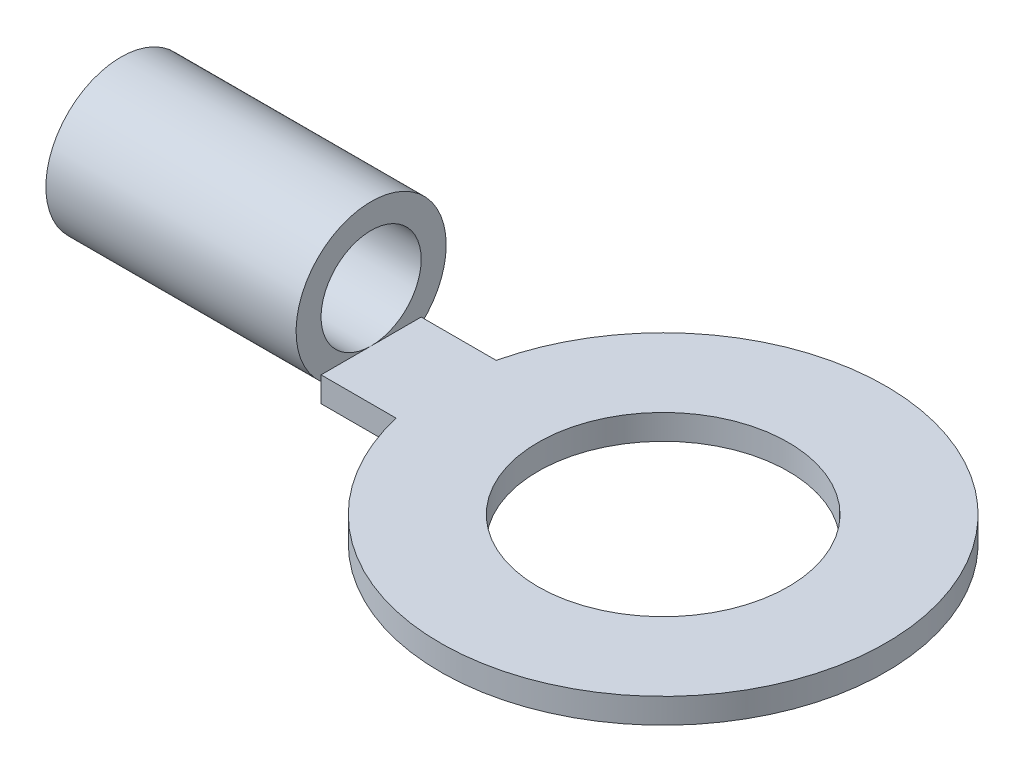
ISO-10303-21;
HEADER;
FILE_DESCRIPTION(('STEP AP214'),'2;1');
FILE_NAME('part.step','',(''),(''),'','','');
FILE_SCHEMA(('AUTOMOTIVE_DESIGN { 1 0 10303 214 1 1 1 1 }'));
ENDSEC;
DATA;
#1=APPLICATION_CONTEXT('core data for automotive mechanical design processes');
#2=APPLICATION_PROTOCOL_DEFINITION('international standard','automotive_design',2000,#1);
#3=PRODUCT_CONTEXT('',#1,'mechanical');
#4=PRODUCT('Part','Part','',(#3));
#5=PRODUCT_RELATED_PRODUCT_CATEGORY('part','',(#4));
#6=PRODUCT_DEFINITION_FORMATION('','',#4);
#7=PRODUCT_DEFINITION_CONTEXT('part definition',#1,'design');
#8=PRODUCT_DEFINITION('design','',#6,#7);
#9=PRODUCT_DEFINITION_SHAPE('','',#8);
#10=(LENGTH_UNIT() NAMED_UNIT(*) SI_UNIT(.MILLI.,.METRE.));
#11=(NAMED_UNIT(*) PLANE_ANGLE_UNIT() SI_UNIT($,.RADIAN.));
#12=(NAMED_UNIT(*) SI_UNIT($,.STERADIAN.) SOLID_ANGLE_UNIT());
#13=UNCERTAINTY_MEASURE_WITH_UNIT(LENGTH_MEASURE(1.E-05),#10,'distance_accuracy_value','');
#14=(GEOMETRIC_REPRESENTATION_CONTEXT(3) GLOBAL_UNCERTAINTY_ASSIGNED_CONTEXT((#13)) GLOBAL_UNIT_ASSIGNED_CONTEXT((#10,
#11,#12)) REPRESENTATION_CONTEXT('',''));
#15=CARTESIAN_POINT('',(0.,0.,0.));
#16=DIRECTION('',(0.,0.,1.));
#17=DIRECTION('',(1.,0.,0.));
#18=AXIS2_PLACEMENT_3D('',#15,#16,#17);
#19=CARTESIAN_POINT('',(0.,0.5,1.));
#20=DIRECTION('',(1.,0.,0.));
#21=DIRECTION('',(0.,0.,-1.));
#22=AXIS2_PLACEMENT_3D('',#19,#20,#21);
#23=PLANE('',#22);
#24=DIRECTION('',(0.,-1.,0.));
#25=VECTOR('',#24,1.);
#26=CARTESIAN_POINT('',(0.,0.5,1.));
#27=LINE('',#26,#25);
#28=CARTESIAN_POINT('',(0.,0.381966011250105,1.));
#29=VERTEX_POINT('',#28);
#30=CARTESIAN_POINT('',(0.,0.,1.));
#31=VERTEX_POINT('',#30);
#32=EDGE_CURVE('E79',#29,#31,#27,.T.);
#33=ORIENTED_EDGE('',*,*,#32,.F.);
#34=CARTESIAN_POINT('',(0.,1.5,0.));
#35=DIRECTION('',(1.,0.,0.));
#36=DIRECTION('',(0.,0.,-1.));
#37=AXIS2_PLACEMENT_3D('',#34,#35,#36);
#38=CIRCLE('',#37,1.5);
#39=CARTESIAN_POINT('',(0.,0.,0.));
#40=VERTEX_POINT('',#39);
#41=EDGE_CURVE('E43',#29,#40,#38,.T.);
#42=ORIENTED_EDGE('',*,*,#41,.T.);
#43=DIRECTION('',(0.,0.,1.));
#44=VECTOR('',#43,1.);
#45=CARTESIAN_POINT('',(0.,0.,1.));
#46=LINE('',#45,#44);
#47=EDGE_CURVE('E93',#40,#31,#46,.T.);
#48=ORIENTED_EDGE('',*,*,#47,.T.);
#49=EDGE_LOOP('',(#33,#42,#48));
#50=FACE_BOUND('',#49,.T.);
#51=ADVANCED_FACE('F33',(#50),#23,.F.);
#52=CARTESIAN_POINT('',(5.83618495915476,0.5,0.));
#53=DIRECTION('',(0.,1.,0.));
#54=DIRECTION('',(0.,0.,1.));
#55=AXIS2_PLACEMENT_3D('',#52,#53,#54);
#56=PLANE('',#55);
#57=DIRECTION('',(1.,0.,0.));
#58=VECTOR('',#57,1.);
#59=CARTESIAN_POINT('',(0.,0.5,1.));
#60=LINE('',#59,#58);
#61=CARTESIAN_POINT('',(0.,0.5,1.));
#62=VERTEX_POINT('',#61);
#63=CARTESIAN_POINT('',(1.5,0.5,0.999999999999999));
#64=VERTEX_POINT('',#63);
#65=EDGE_CURVE('E116',#62,#64,#60,.T.);
#66=ORIENTED_EDGE('',*,*,#65,.T.);
#67=CARTESIAN_POINT('',(5.83618495915476,0.5,0.));
#68=DIRECTION('',(0.,1.,0.));
#69=DIRECTION('',(0.,0.,1.));
#70=AXIS2_PLACEMENT_3D('',#67,#68,#69);
#71=CIRCLE('',#70,4.45);
#72=CARTESIAN_POINT('',(1.5,0.5,-1.));
#73=VERTEX_POINT('',#72);
#74=EDGE_CURVE('E59',#64,#73,#71,.T.);
#75=ORIENTED_EDGE('',*,*,#74,.T.);
#76=DIRECTION('',(-1.,0.,0.));
#77=VECTOR('',#76,1.);
#78=CARTESIAN_POINT('',(0.,0.5,-1.));
#79=LINE('',#78,#77);
#80=CARTESIAN_POINT('',(0.,0.5,-1.));
#81=VERTEX_POINT('',#80);
#82=EDGE_CURVE('E129',#73,#81,#79,.T.);
#83=ORIENTED_EDGE('',*,*,#82,.T.);
#84=DIRECTION('',(0.,0.,1.));
#85=VECTOR('',#84,1.);
#86=CARTESIAN_POINT('',(0.,0.5,1.));
#87=LINE('',#86,#85);
#88=CARTESIAN_POINT('',(0.,0.5,0.));
#89=VERTEX_POINT('',#88);
#90=EDGE_CURVE('E90',#81,#89,#87,.T.);
#91=ORIENTED_EDGE('',*,*,#90,.T.);
#92=EDGE_CURVE('E132',#89,#62,#87,.T.);
#93=ORIENTED_EDGE('',*,*,#92,.T.);
#94=EDGE_LOOP('',(#66,#75,#83,#91,#93));
#95=FACE_BOUND('',#94,.T.);
#96=CARTESIAN_POINT('',(5.83618495915476,0.5,0.));
#97=DIRECTION('',(0.,1.,0.));
#98=DIRECTION('',(0.,0.,1.));
#99=AXIS2_PLACEMENT_3D('',#96,#97,#98);
#100=CIRCLE('',#99,2.5);
#101=CARTESIAN_POINT('',(5.83618495915476,0.5,2.5));
#102=VERTEX_POINT('',#101);
#103=EDGE_CURVE('E106',#102,#102,#100,.T.);
#104=ORIENTED_EDGE('',*,*,#103,.F.);
#105=EDGE_LOOP('',(#104));
#106=FACE_BOUND('',#105,.T.);
#107=ADVANCED_FACE('F138',(#95,#106),#56,.T.);
#108=CARTESIAN_POINT('',(5.83618495915476,0.,0.));
#109=DIRECTION('',(0.,1.,0.));
#110=DIRECTION('',(0.,0.,1.));
#111=AXIS2_PLACEMENT_3D('',#108,#109,#110);
#112=PLANE('',#111);
#113=DIRECTION('',(1.,0.,0.));
#114=VECTOR('',#113,1.);
#115=CARTESIAN_POINT('',(0.,0.,1.));
#116=LINE('',#115,#114);
#117=CARTESIAN_POINT('',(1.5,0.,0.999999999999999));
#118=VERTEX_POINT('',#117);
#119=EDGE_CURVE('E83',#31,#118,#116,.T.);
#120=ORIENTED_EDGE('',*,*,#119,.F.);
#121=ORIENTED_EDGE('',*,*,#47,.F.);
#122=CARTESIAN_POINT('',(0.,0.,-1.));
#123=VERTEX_POINT('',#122);
#124=EDGE_CURVE('E98',#123,#40,#46,.T.);
#125=ORIENTED_EDGE('',*,*,#124,.F.);
#126=DIRECTION('',(-1.,0.,0.));
#127=VECTOR('',#126,1.);
#128=CARTESIAN_POINT('',(0.,0.,-1.));
#129=LINE('',#128,#127);
#130=CARTESIAN_POINT('',(1.5,0.,-1.));
#131=VERTEX_POINT('',#130);
#132=EDGE_CURVE('E99',#131,#123,#129,.T.);
#133=ORIENTED_EDGE('',*,*,#132,.F.);
#134=CARTESIAN_POINT('',(5.83618495915476,0.,0.));
#135=DIRECTION('',(0.,1.,0.));
#136=DIRECTION('',(0.,0.,1.));
#137=AXIS2_PLACEMENT_3D('',#134,#135,#136);
#138=CIRCLE('',#137,4.45);
#139=EDGE_CURVE('E104',#118,#131,#138,.T.);
#140=ORIENTED_EDGE('',*,*,#139,.F.);
#141=EDGE_LOOP('',(#120,#121,#125,#133,#140));
#142=FACE_BOUND('',#141,.T.);
#143=CARTESIAN_POINT('',(5.83618495915476,0.,0.));
#144=DIRECTION('',(0.,1.,0.));
#145=DIRECTION('',(0.,0.,1.));
#146=AXIS2_PLACEMENT_3D('',#143,#144,#145);
#147=CIRCLE('',#146,2.5);
#148=CARTESIAN_POINT('',(5.83618495915476,0.,2.5));
#149=VERTEX_POINT('',#148);
#150=EDGE_CURVE('E110',#149,#149,#147,.T.);
#151=ORIENTED_EDGE('',*,*,#150,.T.);
#152=EDGE_LOOP('',(#151));
#153=FACE_BOUND('',#152,.T.);
#154=ADVANCED_FACE('F101',(#142,#153),#112,.F.);
#155=CARTESIAN_POINT('',(0.,0.5,1.));
#156=DIRECTION('',(0.,0.,-1.));
#157=DIRECTION('',(-1.,0.,0.));
#158=AXIS2_PLACEMENT_3D('',#155,#156,#157);
#159=PLANE('',#158);
#160=ORIENTED_EDGE('',*,*,#119,.T.);
#161=DIRECTION('',(0.,-1.,0.));
#162=VECTOR('',#161,1.);
#163=CARTESIAN_POINT('',(1.5,0.5,0.999999999999999));
#164=LINE('',#163,#162);
#165=EDGE_CURVE('E37',#64,#118,#164,.T.);
#166=ORIENTED_EDGE('',*,*,#165,.F.);
#167=ORIENTED_EDGE('',*,*,#65,.F.);
#168=EDGE_CURVE('E87',#62,#29,#27,.T.);
#169=ORIENTED_EDGE('',*,*,#168,.T.);
#170=ORIENTED_EDGE('',*,*,#32,.T.);
#171=EDGE_LOOP('',(#160,#166,#167,#169,#170));
#172=FACE_BOUND('',#171,.T.);
#173=ADVANCED_FACE('F35',(#172),#159,.F.);
#174=CARTESIAN_POINT('',(5.83618495915476,0.5,0.));
#175=DIRECTION('',(0.,-1.,0.));
#176=DIRECTION('',(0.,0.,-1.));
#177=AXIS2_PLACEMENT_3D('',#174,#175,#176);
#178=CYLINDRICAL_SURFACE('',#177,4.45);
#179=ORIENTED_EDGE('',*,*,#139,.T.);
#180=DIRECTION('',(0.,-1.,0.));
#181=VECTOR('',#180,1.);
#182=CARTESIAN_POINT('',(1.5,0.5,-1.));
#183=LINE('',#182,#181);
#184=EDGE_CURVE('E120',#73,#131,#183,.T.);
#185=ORIENTED_EDGE('',*,*,#184,.F.);
#186=ORIENTED_EDGE('',*,*,#74,.F.);
#187=ORIENTED_EDGE('',*,*,#165,.T.);
#188=EDGE_LOOP('',(#179,#185,#186,#187));
#189=FACE_BOUND('',#188,.T.);
#190=ADVANCED_FACE('F125',(#189),#178,.T.);
#191=CARTESIAN_POINT('',(0.,0.5,-1.));
#192=DIRECTION('',(0.,0.,1.));
#193=DIRECTION('',(1.,0.,0.));
#194=AXIS2_PLACEMENT_3D('',#191,#192,#193);
#195=PLANE('',#194);
#196=ORIENTED_EDGE('',*,*,#132,.T.);
#197=DIRECTION('',(0.,-1.,0.));
#198=VECTOR('',#197,1.);
#199=CARTESIAN_POINT('',(0.,0.5,-1.));
#200=LINE('',#199,#198);
#201=CARTESIAN_POINT('',(0.,0.381966011250105,-1.));
#202=VERTEX_POINT('',#201);
#203=EDGE_CURVE('E118',#202,#123,#200,.T.);
#204=ORIENTED_EDGE('',*,*,#203,.F.);
#205=EDGE_CURVE('E119',#81,#202,#200,.T.);
#206=ORIENTED_EDGE('',*,*,#205,.F.);
#207=ORIENTED_EDGE('',*,*,#82,.F.);
#208=ORIENTED_EDGE('',*,*,#184,.T.);
#209=EDGE_LOOP('',(#196,#204,#206,#207,#208));
#210=FACE_BOUND('',#209,.T.);
#211=ADVANCED_FACE('F181',(#210),#195,.F.);
#212=ORIENTED_EDGE('',*,*,#124,.T.);
#213=EDGE_CURVE('E11',#40,#202,#38,.T.);
#214=ORIENTED_EDGE('',*,*,#213,.T.);
#215=ORIENTED_EDGE('',*,*,#203,.T.);
#216=EDGE_LOOP('',(#212,#214,#215));
#217=FACE_BOUND('',#216,.T.);
#218=ADVANCED_FACE('F172',(#217),#23,.F.);
#219=CARTESIAN_POINT('',(5.83618495915476,0.5,0.));
#220=DIRECTION('',(0.,-1.,0.));
#221=DIRECTION('',(0.,0.,-1.));
#222=AXIS2_PLACEMENT_3D('',#219,#220,#221);
#223=CYLINDRICAL_SURFACE('',#222,2.5);
#224=ORIENTED_EDGE('',*,*,#103,.T.);
#225=EDGE_LOOP('',(#224));
#226=FACE_BOUND('',#225,.T.);
#227=ORIENTED_EDGE('',*,*,#150,.F.);
#228=EDGE_LOOP('',(#227));
#229=FACE_BOUND('',#228,.T.);
#230=ADVANCED_FACE('F180',(#226,#229),#223,.F.);
#231=CARTESIAN_POINT('',(0.,1.5,0.));
#232=DIRECTION('',(1.,0.,0.));
#233=DIRECTION('',(0.,0.,-1.));
#234=AXIS2_PLACEMENT_3D('',#231,#232,#233);
#235=PLANE('',#234);
#236=ORIENTED_EDGE('',*,*,#168,.F.);
#237=ORIENTED_EDGE('',*,*,#92,.F.);
#238=CARTESIAN_POINT('',(0.,1.5,0.));
#239=DIRECTION('',(1.,0.,0.));
#240=DIRECTION('',(0.,0.,-1.));
#241=AXIS2_PLACEMENT_3D('',#238,#239,#240);
#242=CIRCLE('',#241,1.);
#243=EDGE_CURVE('E145',#89,#89,#242,.T.);
#244=ORIENTED_EDGE('',*,*,#243,.F.);
#245=ORIENTED_EDGE('',*,*,#90,.F.);
#246=ORIENTED_EDGE('',*,*,#205,.T.);
#247=EDGE_CURVE('E44',#202,#29,#38,.T.);
#248=ORIENTED_EDGE('',*,*,#247,.T.);
#249=EDGE_LOOP('',(#236,#237,#244,#245,#246,#248));
#250=FACE_BOUND('',#249,.T.);
#251=ADVANCED_FACE('F143',(#250),#235,.T.);
#252=CARTESIAN_POINT('',(-5.,1.5,0.));
#253=DIRECTION('',(1.,0.,0.));
#254=DIRECTION('',(0.,0.,-1.));
#255=AXIS2_PLACEMENT_3D('',#252,#253,#254);
#256=CYLINDRICAL_SURFACE('',#255,1.5);
#257=CARTESIAN_POINT('',(-5.,1.5,0.));
#258=DIRECTION('',(1.,0.,0.));
#259=DIRECTION('',(0.,0.,-1.));
#260=AXIS2_PLACEMENT_3D('',#257,#258,#259);
#261=CIRCLE('',#260,1.5);
#262=CARTESIAN_POINT('',(-5.,1.5,-1.5));
#263=VERTEX_POINT('',#262);
#264=EDGE_CURVE('E151',#263,#263,#261,.T.);
#265=ORIENTED_EDGE('',*,*,#264,.T.);
#266=EDGE_LOOP('',(#265));
#267=FACE_BOUND('',#266,.T.);
#268=ORIENTED_EDGE('',*,*,#41,.F.);
#269=ORIENTED_EDGE('',*,*,#247,.F.);
#270=ORIENTED_EDGE('',*,*,#213,.F.);
#271=EDGE_LOOP('',(#268,#269,#270));
#272=FACE_BOUND('',#271,.T.);
#273=ADVANCED_FACE('F150',(#267,#272),#256,.T.);
#274=CARTESIAN_POINT('',(-5.,1.5,0.));
#275=DIRECTION('',(1.,0.,0.));
#276=DIRECTION('',(0.,0.,-1.));
#277=AXIS2_PLACEMENT_3D('',#274,#275,#276);
#278=PLANE('',#277);
#279=CARTESIAN_POINT('',(-5.,1.5,0.));
#280=DIRECTION('',(1.,0.,0.));
#281=DIRECTION('',(0.,0.,-1.));
#282=AXIS2_PLACEMENT_3D('',#279,#280,#281);
#283=CIRCLE('',#282,1.);
#284=CARTESIAN_POINT('',(-5.,1.5,-1.));
#285=VERTEX_POINT('',#284);
#286=EDGE_CURVE('E149',#285,#285,#283,.T.);
#287=ORIENTED_EDGE('',*,*,#286,.T.);
#288=EDGE_LOOP('',(#287));
#289=FACE_BOUND('',#288,.T.);
#290=ORIENTED_EDGE('',*,*,#264,.F.);
#291=EDGE_LOOP('',(#290));
#292=FACE_BOUND('',#291,.T.);
#293=ADVANCED_FACE('F159',(#289,#292),#278,.F.);
#294=CARTESIAN_POINT('',(-5.,1.5,0.));
#295=DIRECTION('',(1.,0.,0.));
#296=DIRECTION('',(0.,0.,-1.));
#297=AXIS2_PLACEMENT_3D('',#294,#295,#296);
#298=CYLINDRICAL_SURFACE('',#297,1.);
#299=ORIENTED_EDGE('',*,*,#286,.F.);
#300=EDGE_LOOP('',(#299));
#301=FACE_BOUND('',#300,.T.);
#302=ORIENTED_EDGE('',*,*,#243,.T.);
#303=EDGE_LOOP('',(#302));
#304=FACE_BOUND('',#303,.T.);
#305=ADVANCED_FACE('F162',(#301,#304),#298,.F.);
#306=CLOSED_SHELL('',(#51,#107,#154,#173,#190,#211,#218,#230,#251,#273,#293,#305));
#307=MANIFOLD_SOLID_BREP('B2',#306);
#308=ADVANCED_BREP_SHAPE_REPRESENTATION('',(#18,#307),#14);
#309=SHAPE_DEFINITION_REPRESENTATION(#9,#308);
ENDSEC;
END-ISO-10303-21;
